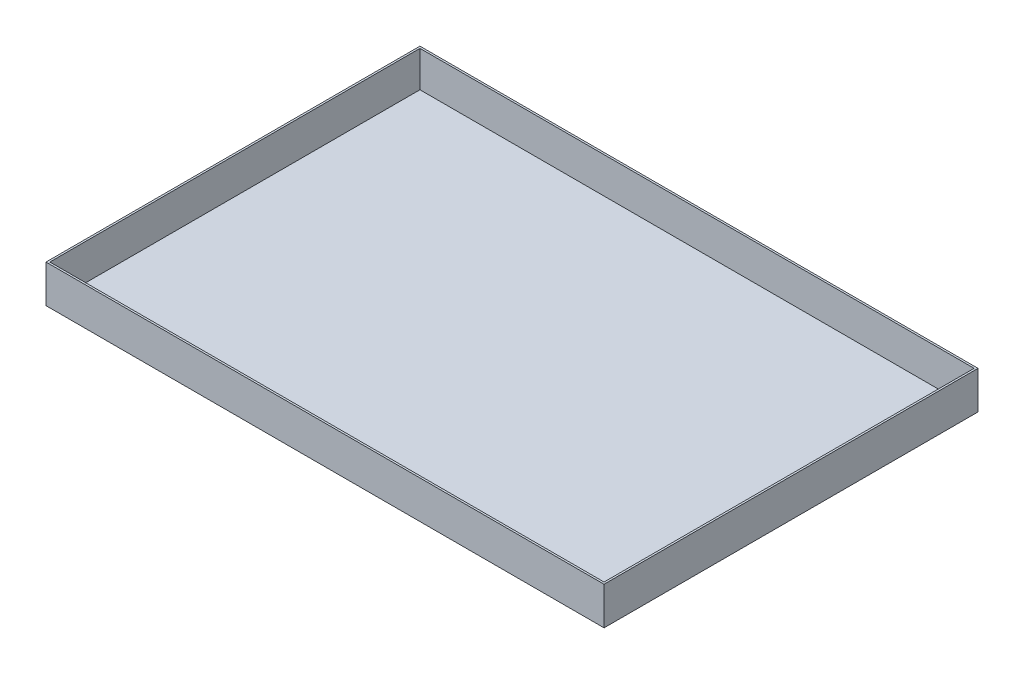
ISO-10303-21;
HEADER;
FILE_DESCRIPTION(('STEP AP214'),'2;1');
FILE_NAME('part.step','',(''),(''),'','','');
FILE_SCHEMA(('AUTOMOTIVE_DESIGN { 1 0 10303 214 1 1 1 1 }'));
ENDSEC;
DATA;
#1=APPLICATION_CONTEXT('core data for automotive mechanical design processes');
#2=APPLICATION_PROTOCOL_DEFINITION('international standard','automotive_design',2000,#1);
#3=PRODUCT_CONTEXT('',#1,'mechanical');
#4=PRODUCT('Part','Part','',(#3));
#5=PRODUCT_RELATED_PRODUCT_CATEGORY('part','',(#4));
#6=PRODUCT_DEFINITION_FORMATION('','',#4);
#7=PRODUCT_DEFINITION_CONTEXT('part definition',#1,'design');
#8=PRODUCT_DEFINITION('design','',#6,#7);
#9=PRODUCT_DEFINITION_SHAPE('','',#8);
#10=(LENGTH_UNIT() NAMED_UNIT(*) SI_UNIT(.MILLI.,.METRE.));
#11=(NAMED_UNIT(*) PLANE_ANGLE_UNIT() SI_UNIT($,.RADIAN.));
#12=(NAMED_UNIT(*) SI_UNIT($,.STERADIAN.) SOLID_ANGLE_UNIT());
#13=UNCERTAINTY_MEASURE_WITH_UNIT(LENGTH_MEASURE(1.E-05),#10,'distance_accuracy_value','');
#14=(GEOMETRIC_REPRESENTATION_CONTEXT(3) GLOBAL_UNCERTAINTY_ASSIGNED_CONTEXT((#13)) GLOBAL_UNIT_ASSIGNED_CONTEXT((#10,
#11,#12)) REPRESENTATION_CONTEXT('',''));
#15=CARTESIAN_POINT('',(0.,0.,0.));
#16=DIRECTION('',(0.,0.,1.));
#17=DIRECTION('',(1.,0.,0.));
#18=AXIS2_PLACEMENT_3D('',#15,#16,#17);
#19=CARTESIAN_POINT('',(0.,3.175,0.));
#20=DIRECTION('',(0.,1.,0.));
#21=DIRECTION('',(0.,0.,1.));
#22=AXIS2_PLACEMENT_3D('',#19,#20,#21);
#23=PLANE('',#22);
#24=DIRECTION('',(0.,0.,1.));
#25=VECTOR('',#24,1.);
#26=CARTESIAN_POINT('',(920.75,3.175,0.));
#27=LINE('',#26,#25);
#28=CARTESIAN_POINT('',(920.75,3.175,-615.95));
#29=VERTEX_POINT('',#28);
#30=CARTESIAN_POINT('',(920.75,3.175,-3.17500000000004));
#31=VERTEX_POINT('',#30);
#32=EDGE_CURVE('E112',#29,#31,#27,.T.);
#33=ORIENTED_EDGE('',*,*,#32,.F.);
#34=DIRECTION('',(1.,0.,0.));
#35=VECTOR('',#34,1.);
#36=CARTESIAN_POINT('',(920.75,3.175,-615.95));
#37=LINE('',#36,#35);
#38=CARTESIAN_POINT('',(3.175,3.175,-615.95));
#39=VERTEX_POINT('',#38);
#40=EDGE_CURVE('E100',#39,#29,#37,.T.);
#41=ORIENTED_EDGE('',*,*,#40,.F.);
#42=DIRECTION('',(0.,0.,-1.));
#43=VECTOR('',#42,1.);
#44=CARTESIAN_POINT('',(3.175,3.175,0.));
#45=LINE('',#44,#43);
#46=CARTESIAN_POINT('',(3.175,3.175,-3.175));
#47=VERTEX_POINT('',#46);
#48=EDGE_CURVE('E111',#47,#39,#45,.T.);
#49=ORIENTED_EDGE('',*,*,#48,.F.);
#50=DIRECTION('',(-1.,0.,0.));
#51=VECTOR('',#50,1.);
#52=CARTESIAN_POINT('',(3.175,3.175,-3.175));
#53=LINE('',#52,#51);
#54=EDGE_CURVE('E174',#31,#47,#53,.T.);
#55=ORIENTED_EDGE('',*,*,#54,.F.);
#56=EDGE_LOOP('',(#33,#41,#49,#55));
#57=FACE_BOUND('',#56,.T.);
#58=ADVANCED_FACE('F33',(#57),#23,.T.);
#59=CARTESIAN_POINT('',(3.175,62.575,0.));
#60=DIRECTION('',(-1.,0.,0.));
#61=DIRECTION('',(0.,0.,1.));
#62=AXIS2_PLACEMENT_3D('',#59,#60,#61);
#63=PLANE('',#62);
#64=DIRECTION('',(0.,-1.,0.));
#65=VECTOR('',#64,1.);
#66=CARTESIAN_POINT('',(3.175,980.155493063143,-615.95));
#67=LINE('',#66,#65);
#68=CARTESIAN_POINT('',(3.175,62.575,-615.95));
#69=VERTEX_POINT('',#68);
#70=EDGE_CURVE('E97',#69,#39,#67,.T.);
#71=ORIENTED_EDGE('',*,*,#70,.F.);
#72=DIRECTION('',(0.,0.,-1.));
#73=VECTOR('',#72,1.);
#74=CARTESIAN_POINT('',(3.175,62.575,0.));
#75=LINE('',#74,#73);
#76=CARTESIAN_POINT('',(3.175,62.575,-3.175));
#77=VERTEX_POINT('',#76);
#78=EDGE_CURVE('E162',#77,#69,#75,.T.);
#79=ORIENTED_EDGE('',*,*,#78,.F.);
#80=DIRECTION('',(0.,-1.,0.));
#81=VECTOR('',#80,1.);
#82=CARTESIAN_POINT('',(3.175,980.155493063143,-3.175));
#83=LINE('',#82,#81);
#84=EDGE_CURVE('E117',#77,#47,#83,.T.);
#85=ORIENTED_EDGE('',*,*,#84,.T.);
#86=ORIENTED_EDGE('',*,*,#48,.T.);
#87=EDGE_LOOP('',(#71,#79,#85,#86));
#88=FACE_BOUND('',#87,.T.);
#89=ADVANCED_FACE('F115',(#88),#63,.F.);
#90=CARTESIAN_POINT('',(920.75,62.575,0.));
#91=DIRECTION('',(1.,0.,0.));
#92=DIRECTION('',(0.,0.,-1.));
#93=AXIS2_PLACEMENT_3D('',#90,#91,#92);
#94=PLANE('',#93);
#95=DIRECTION('',(0.,-1.,0.));
#96=VECTOR('',#95,1.);
#97=CARTESIAN_POINT('',(920.75,980.155493063143,-615.95));
#98=LINE('',#97,#96);
#99=CARTESIAN_POINT('',(920.75,62.575,-615.95));
#100=VERTEX_POINT('',#99);
#101=EDGE_CURVE('E48',#100,#29,#98,.T.);
#102=ORIENTED_EDGE('',*,*,#101,.T.);
#103=ORIENTED_EDGE('',*,*,#32,.T.);
#104=DIRECTION('',(0.,-1.,0.));
#105=VECTOR('',#104,1.);
#106=CARTESIAN_POINT('',(920.75,980.155493063143,-3.17500000000004));
#107=LINE('',#106,#105);
#108=CARTESIAN_POINT('',(920.75,62.575,-3.17500000000004));
#109=VERTEX_POINT('',#108);
#110=EDGE_CURVE('E170',#109,#31,#107,.T.);
#111=ORIENTED_EDGE('',*,*,#110,.F.);
#112=DIRECTION('',(0.,0.,1.));
#113=VECTOR('',#112,1.);
#114=CARTESIAN_POINT('',(920.75,62.575,0.));
#115=LINE('',#114,#113);
#116=EDGE_CURVE('E119',#100,#109,#115,.T.);
#117=ORIENTED_EDGE('',*,*,#116,.F.);
#118=EDGE_LOOP('',(#102,#103,#111,#117));
#119=FACE_BOUND('',#118,.T.);
#120=ADVANCED_FACE('F179',(#119),#94,.F.);
#121=CARTESIAN_POINT('',(0.,3.175,0.));
#122=DIRECTION('',(0.,0.,-1.));
#123=DIRECTION('',(-1.,0.,0.));
#124=AXIS2_PLACEMENT_3D('',#121,#122,#123);
#125=PLANE('',#124);
#126=DIRECTION('',(1.,0.,0.));
#127=VECTOR('',#126,1.);
#128=CARTESIAN_POINT('',(0.,0.,0.));
#129=LINE('',#128,#127);
#130=CARTESIAN_POINT('',(0.,0.,0.));
#131=VERTEX_POINT('',#130);
#132=CARTESIAN_POINT('',(923.925,0.,0.));
#133=VERTEX_POINT('',#132);
#134=EDGE_CURVE('E130',#131,#133,#129,.T.);
#135=ORIENTED_EDGE('',*,*,#134,.T.);
#136=DIRECTION('',(0.,-1.,0.));
#137=VECTOR('',#136,1.);
#138=CARTESIAN_POINT('',(923.925,3.175,0.));
#139=LINE('',#138,#137);
#140=CARTESIAN_POINT('',(923.925,62.575,0.));
#141=VERTEX_POINT('',#140);
#142=EDGE_CURVE('E11',#141,#133,#139,.T.);
#143=ORIENTED_EDGE('',*,*,#142,.F.);
#144=DIRECTION('',(1.,0.,0.));
#145=VECTOR('',#144,1.);
#146=CARTESIAN_POINT('',(0.,62.575,0.));
#147=LINE('',#146,#145);
#148=CARTESIAN_POINT('',(0.,62.575,0.));
#149=VERTEX_POINT('',#148);
#150=EDGE_CURVE('E122',#149,#141,#147,.T.);
#151=ORIENTED_EDGE('',*,*,#150,.F.);
#152=DIRECTION('',(0.,-1.,0.));
#153=VECTOR('',#152,1.);
#154=CARTESIAN_POINT('',(0.,3.175,0.));
#155=LINE('',#154,#153);
#156=EDGE_CURVE('E56',#149,#131,#155,.T.);
#157=ORIENTED_EDGE('',*,*,#156,.T.);
#158=EDGE_LOOP('',(#135,#143,#151,#157));
#159=FACE_BOUND('',#158,.T.);
#160=ADVANCED_FACE('F35',(#159),#125,.F.);
#161=CARTESIAN_POINT('',(923.925,3.175,0.));
#162=DIRECTION('',(-1.,0.,0.));
#163=DIRECTION('',(0.,0.,1.));
#164=AXIS2_PLACEMENT_3D('',#161,#162,#163);
#165=PLANE('',#164);
#166=DIRECTION('',(0.,0.,-1.));
#167=VECTOR('',#166,1.);
#168=CARTESIAN_POINT('',(923.925,0.,0.));
#169=LINE('',#168,#167);
#170=CARTESIAN_POINT('',(923.925,0.,-619.125));
#171=VERTEX_POINT('',#170);
#172=EDGE_CURVE('E132',#133,#171,#169,.T.);
#173=ORIENTED_EDGE('',*,*,#172,.T.);
#174=DIRECTION('',(0.,-1.,0.));
#175=VECTOR('',#174,1.);
#176=CARTESIAN_POINT('',(923.925,3.175,-619.125));
#177=LINE('',#176,#175);
#178=CARTESIAN_POINT('',(923.925,62.575,-619.125));
#179=VERTEX_POINT('',#178);
#180=EDGE_CURVE('E41',#179,#171,#177,.T.);
#181=ORIENTED_EDGE('',*,*,#180,.F.);
#182=DIRECTION('',(0.,0.,-1.));
#183=VECTOR('',#182,1.);
#184=CARTESIAN_POINT('',(923.925,62.575,0.));
#185=LINE('',#184,#183);
#186=EDGE_CURVE('E124',#141,#179,#185,.T.);
#187=ORIENTED_EDGE('',*,*,#186,.F.);
#188=ORIENTED_EDGE('',*,*,#142,.T.);
#189=EDGE_LOOP('',(#173,#181,#187,#188));
#190=FACE_BOUND('',#189,.T.);
#191=ADVANCED_FACE('F151',(#190),#165,.F.);
#192=CARTESIAN_POINT('',(0.,3.175,-619.125));
#193=DIRECTION('',(0.,0.,-1.));
#194=DIRECTION('',(-1.,0.,0.));
#195=AXIS2_PLACEMENT_3D('',#192,#193,#194);
#196=PLANE('',#195);
#197=DIRECTION('',(1.,0.,0.));
#198=VECTOR('',#197,1.);
#199=CARTESIAN_POINT('',(0.,0.,-619.125));
#200=LINE('',#199,#198);
#201=CARTESIAN_POINT('',(0.,0.,-619.125));
#202=VERTEX_POINT('',#201);
#203=EDGE_CURVE('E135',#202,#171,#200,.T.);
#204=ORIENTED_EDGE('',*,*,#203,.F.);
#205=DIRECTION('',(0.,-1.,0.));
#206=VECTOR('',#205,1.);
#207=CARTESIAN_POINT('',(0.,3.175,-619.125));
#208=LINE('',#207,#206);
#209=CARTESIAN_POINT('',(0.,62.575,-619.125));
#210=VERTEX_POINT('',#209);
#211=EDGE_CURVE('E142',#210,#202,#208,.T.);
#212=ORIENTED_EDGE('',*,*,#211,.F.);
#213=DIRECTION('',(-1.,0.,0.));
#214=VECTOR('',#213,1.);
#215=CARTESIAN_POINT('',(0.,62.575,-619.125));
#216=LINE('',#215,#214);
#217=EDGE_CURVE('E128',#179,#210,#216,.T.);
#218=ORIENTED_EDGE('',*,*,#217,.F.);
#219=ORIENTED_EDGE('',*,*,#180,.T.);
#220=EDGE_LOOP('',(#204,#212,#218,#219));
#221=FACE_BOUND('',#220,.T.);
#222=ADVANCED_FACE('F146',(#221),#196,.T.);
#223=CARTESIAN_POINT('',(0.,3.175,0.));
#224=DIRECTION('',(-1.,0.,0.));
#225=DIRECTION('',(0.,0.,1.));
#226=AXIS2_PLACEMENT_3D('',#223,#224,#225);
#227=PLANE('',#226);
#228=DIRECTION('',(0.,0.,-1.));
#229=VECTOR('',#228,1.);
#230=CARTESIAN_POINT('',(0.,0.,0.));
#231=LINE('',#230,#229);
#232=EDGE_CURVE('E138',#131,#202,#231,.T.);
#233=ORIENTED_EDGE('',*,*,#232,.F.);
#234=ORIENTED_EDGE('',*,*,#156,.F.);
#235=DIRECTION('',(0.,0.,1.));
#236=VECTOR('',#235,1.);
#237=CARTESIAN_POINT('',(0.,62.575,0.));
#238=LINE('',#237,#236);
#239=EDGE_CURVE('E118',#210,#149,#238,.T.);
#240=ORIENTED_EDGE('',*,*,#239,.F.);
#241=ORIENTED_EDGE('',*,*,#211,.T.);
#242=EDGE_LOOP('',(#233,#234,#240,#241));
#243=FACE_BOUND('',#242,.T.);
#244=ADVANCED_FACE('F157',(#243),#227,.T.);
#245=CARTESIAN_POINT('',(0.,0.,0.));
#246=DIRECTION('',(0.,1.,0.));
#247=DIRECTION('',(0.,0.,1.));
#248=AXIS2_PLACEMENT_3D('',#245,#246,#247);
#249=PLANE('',#248);
#250=ORIENTED_EDGE('',*,*,#134,.F.);
#251=ORIENTED_EDGE('',*,*,#232,.T.);
#252=ORIENTED_EDGE('',*,*,#203,.T.);
#253=ORIENTED_EDGE('',*,*,#172,.F.);
#254=EDGE_LOOP('',(#250,#251,#252,#253));
#255=FACE_BOUND('',#254,.T.);
#256=ADVANCED_FACE('F154',(#255),#249,.F.);
#257=CARTESIAN_POINT('',(0.,62.575,0.));
#258=DIRECTION('',(0.,-1.,0.));
#259=DIRECTION('',(0.,0.,-1.));
#260=AXIS2_PLACEMENT_3D('',#257,#258,#259);
#261=PLANE('',#260);
#262=ORIENTED_EDGE('',*,*,#186,.T.);
#263=ORIENTED_EDGE('',*,*,#217,.T.);
#264=ORIENTED_EDGE('',*,*,#239,.T.);
#265=ORIENTED_EDGE('',*,*,#150,.T.);
#266=EDGE_LOOP('',(#262,#263,#264,#265));
#267=FACE_BOUND('',#266,.T.);
#268=ORIENTED_EDGE('',*,*,#78,.T.);
#269=DIRECTION('',(-1.,0.,0.));
#270=VECTOR('',#269,1.);
#271=CARTESIAN_POINT('',(920.75,62.575,-615.95));
#272=LINE('',#271,#270);
#273=EDGE_CURVE('E101',#100,#69,#272,.T.);
#274=ORIENTED_EDGE('',*,*,#273,.F.);
#275=ORIENTED_EDGE('',*,*,#116,.T.);
#276=DIRECTION('',(1.,0.,0.));
#277=VECTOR('',#276,1.);
#278=CARTESIAN_POINT('',(3.175,62.575,-3.175));
#279=LINE('',#278,#277);
#280=EDGE_CURVE('E165',#77,#109,#279,.T.);
#281=ORIENTED_EDGE('',*,*,#280,.F.);
#282=EDGE_LOOP('',(#268,#274,#275,#281));
#283=FACE_BOUND('',#282,.T.);
#284=ADVANCED_FACE('F160',(#267,#283),#261,.F.);
#285=CARTESIAN_POINT('',(3.175,980.155493063143,-3.175));
#286=DIRECTION('',(0.,0.,1.));
#287=DIRECTION('',(1.,0.,0.));
#288=AXIS2_PLACEMENT_3D('',#285,#286,#287);
#289=PLANE('',#288);
#290=ORIENTED_EDGE('',*,*,#84,.F.);
#291=ORIENTED_EDGE('',*,*,#280,.T.);
#292=ORIENTED_EDGE('',*,*,#110,.T.);
#293=ORIENTED_EDGE('',*,*,#54,.T.);
#294=EDGE_LOOP('',(#290,#291,#292,#293));
#295=FACE_BOUND('',#294,.T.);
#296=ADVANCED_FACE('F182',(#295),#289,.F.);
#297=CARTESIAN_POINT('',(920.75,980.155493063143,-615.95));
#298=DIRECTION('',(0.,0.,-1.));
#299=DIRECTION('',(-1.,0.,0.));
#300=AXIS2_PLACEMENT_3D('',#297,#298,#299);
#301=PLANE('',#300);
#302=ORIENTED_EDGE('',*,*,#101,.F.);
#303=ORIENTED_EDGE('',*,*,#273,.T.);
#304=ORIENTED_EDGE('',*,*,#70,.T.);
#305=ORIENTED_EDGE('',*,*,#40,.T.);
#306=EDGE_LOOP('',(#302,#303,#304,#305));
#307=FACE_BOUND('',#306,.T.);
#308=ADVANCED_FACE('F99',(#307),#301,.F.);
#309=CLOSED_SHELL('',(#58,#89,#120,#160,#191,#222,#244,#256,#284,#296,#308));
#310=MANIFOLD_SOLID_BREP('B2',#309);
#311=ADVANCED_BREP_SHAPE_REPRESENTATION('',(#18,#310),#14);
#312=SHAPE_DEFINITION_REPRESENTATION(#9,#311);
ENDSEC;
END-ISO-10303-21;
